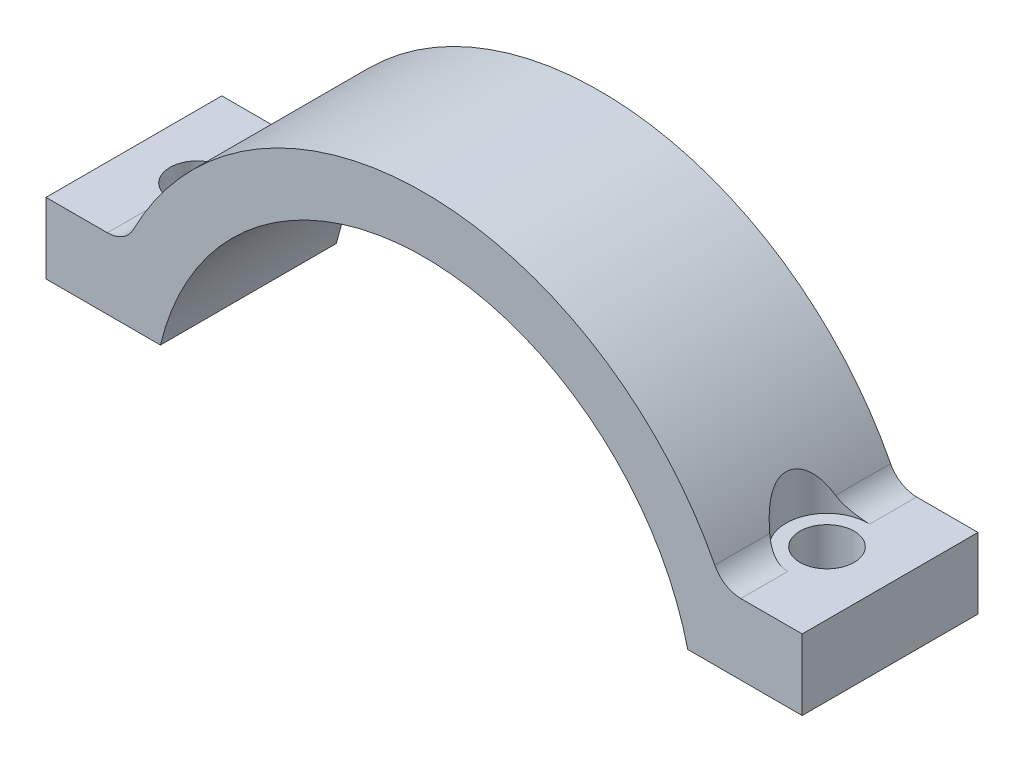
ISO-10303-21;
HEADER;
FILE_DESCRIPTION(('STEP AP214'),'2;1');
FILE_NAME('part.step','',(''),(''),'','','');
FILE_SCHEMA(('AUTOMOTIVE_DESIGN { 1 0 10303 214 1 1 1 1 }'));
ENDSEC;
DATA;
#1=APPLICATION_CONTEXT('core data for automotive mechanical design processes');
#2=APPLICATION_PROTOCOL_DEFINITION('international standard','automotive_design',2000,#1);
#3=PRODUCT_CONTEXT('',#1,'mechanical');
#4=PRODUCT('Part','Part','',(#3));
#5=PRODUCT_RELATED_PRODUCT_CATEGORY('part','',(#4));
#6=PRODUCT_DEFINITION_FORMATION('','',#4);
#7=PRODUCT_DEFINITION_CONTEXT('part definition',#1,'design');
#8=PRODUCT_DEFINITION('design','',#6,#7);
#9=PRODUCT_DEFINITION_SHAPE('','',#8);
#10=(LENGTH_UNIT() NAMED_UNIT(*) SI_UNIT(.MILLI.,.METRE.));
#11=(NAMED_UNIT(*) PLANE_ANGLE_UNIT() SI_UNIT($,.RADIAN.));
#12=(NAMED_UNIT(*) SI_UNIT($,.STERADIAN.) SOLID_ANGLE_UNIT());
#13=UNCERTAINTY_MEASURE_WITH_UNIT(LENGTH_MEASURE(1.E-05),#10,'distance_accuracy_value','');
#14=(GEOMETRIC_REPRESENTATION_CONTEXT(3) GLOBAL_UNCERTAINTY_ASSIGNED_CONTEXT((#13)) GLOBAL_UNIT_ASSIGNED_CONTEXT((#10,
#11,#12)) REPRESENTATION_CONTEXT('',''));
#15=CARTESIAN_POINT('',(0.,0.,0.));
#16=DIRECTION('',(0.,0.,1.));
#17=DIRECTION('',(1.,0.,0.));
#18=AXIS2_PLACEMENT_3D('',#15,#16,#17);
#19=CARTESIAN_POINT('',(0.,-4.2926,-6.));
#20=DIRECTION('',(0.,0.,1.));
#21=DIRECTION('',(1.,0.,0.));
#22=AXIS2_PLACEMENT_3D('',#19,#20,#21);
#23=CYLINDRICAL_SURFACE('',#22,22.31);
#24=DIRECTION('',(0.,0.,1.));
#25=VECTOR('',#24,1.);
#26=CARTESIAN_POINT('',(19.8397891236743,5.91126532291239,-6.));
#27=LINE('',#26,#25);
#28=CARTESIAN_POINT('',(19.8397891236743,5.91126532291239,6.));
#29=VERTEX_POINT('',#28);
#30=CARTESIAN_POINT('',(19.8397891236743,5.91126532291239,2.24725073058836));
#31=VERTEX_POINT('',#30);
#32=EDGE_CURVE('E172',#29,#31,#27,.F.);
#33=ORIENTED_EDGE('',*,*,#32,.T.);
#34=CARTESIAN_POINT('',(20.3614153250701,4.82599999999998,2.55148210615219));
#35=CARTESIAN_POINT('',(20.3280694721854,4.90046048004282,2.53659897847476));
#36=CARTESIAN_POINT('',(20.2943847142534,4.97458096420463,2.52078649791196));
#37=CARTESIAN_POINT('',(20.226380273653,5.12208202628067,2.48712102479289));
#38=CARTESIAN_POINT('',(20.1920604602027,5.19546244687044,2.46926760792105));
#39=CARTESIAN_POINT('',(20.0879884501193,5.41487474667107,2.41224850160538));
#40=CARTESIAN_POINT('',(20.0173608796664,5.55964846974581,2.36972692499178));
#41=CARTESIAN_POINT('',(19.8735992485431,5.84654227079861,2.27350645658121));
#42=CARTESIAN_POINT('',(19.8004453402816,5.98861010651654,2.21968030562438));
#43=CARTESIAN_POINT('',(19.6535731195594,6.26665120377286,2.09908790988041));
#44=CARTESIAN_POINT('',(19.5798559463395,6.40263419602366,2.03234330610812));
#45=CARTESIAN_POINT('',(19.4734198675087,6.59439845708756,1.9239668632264));
#46=CARTESIAN_POINT('',(19.4402803991314,6.6534515220663,1.88850684325897));
#47=CARTESIAN_POINT('',(19.3744463318672,6.76956032713479,1.81409111820734));
#48=CARTESIAN_POINT('',(19.3417517550785,6.82661596823024,1.77513524020498));
#49=CARTESIAN_POINT('',(19.2447205519902,6.9942683196101,1.65258306037027));
#50=CARTESIAN_POINT('',(19.1813829687301,7.10144645703703,1.56324949943804));
#51=CARTESIAN_POINT('',(19.0903266308908,7.25292376608362,1.41538450957065));
#52=CARTESIAN_POINT('',(19.0604059769422,7.30223006494246,1.36330322697164));
#53=CARTESIAN_POINT('',(19.0026555476212,7.3966363191625,1.25440235185756));
#54=CARTESIAN_POINT('',(18.9748261523064,7.44173551029697,1.19758190200332));
#55=CARTESIAN_POINT('',(18.8956664009311,7.5690932980264,1.02006387769636));
#56=CARTESIAN_POINT('',(18.8483190553691,7.64398192248844,0.891776707012844));
#57=CARTESIAN_POINT('',(18.7870262077867,7.74008909088639,0.673326519521865));
#58=CARTESIAN_POINT('',(18.7673272307517,7.77074891815222,0.588872188503999));
#59=CARTESIAN_POINT('',(18.7355992249913,7.81996693364017,0.415083235888803));
#60=CARTESIAN_POINT('',(18.723564465319,7.83853416438247,0.325752315177732));
#61=CARTESIAN_POINT('',(18.7082243995548,7.86217908851298,0.144108191662494));
#62=CARTESIAN_POINT('',(18.7049614802327,7.86719128274683,0.0517826821480479));
#63=CARTESIAN_POINT('',(18.7076204008867,7.86310001371665,-0.132422403836633));
#64=CARTESIAN_POINT('',(18.7135425658574,7.85399605098286,-0.224301964412537));
#65=CARTESIAN_POINT('',(18.7333143949927,7.82347708142833,-0.398897799879052));
#66=CARTESIAN_POINT('',(18.7466316385245,7.80288851795348,-0.481823945326988));
#67=CARTESIAN_POINT('',(18.7797503864223,7.75140302841609,-0.643009497285997));
#68=CARTESIAN_POINT('',(18.7995545872151,7.72050181560441,-0.721266947147147));
#69=CARTESIAN_POINT('',(18.8543731468228,7.63435771664486,-0.905529878202226));
#70=CARTESIAN_POINT('',(18.8922393202388,7.57439545148714,-1.0084745864709));
#71=CARTESIAN_POINT('',(18.975436355526,7.44090324843374,-1.20172704288127));
#72=CARTESIAN_POINT('',(19.0207812202654,7.36734782740215,-1.29201048629595));
#73=CARTESIAN_POINT('',(19.1055235783666,7.2278250217213,-1.44172485308487));
#74=CARTESIAN_POINT('',(19.1439984878001,7.16381255392154,-1.50355019897401));
#75=CARTESIAN_POINT('',(19.2228637065737,7.03098492974606,-1.62051415349791));
#76=CARTESIAN_POINT('',(19.2632551671324,6.96216687477797,-1.67564867056349));
#77=CARTESIAN_POINT('',(19.3454178709917,6.82035018479202,-1.78007001614864));
#78=CARTESIAN_POINT('',(19.387195358302,6.74733108695688,-1.82932385715973));
#79=CARTESIAN_POINT('',(19.4713825977721,6.59816245520193,-1.92225813611611));
#80=CARTESIAN_POINT('',(19.5137925684104,6.52201182280997,-1.96593659590949));
#81=CARTESIAN_POINT('',(19.6259183118197,6.3177868863908,-2.07452752233423));
#82=CARTESIAN_POINT('',(19.695805066428,6.18756066756622,-2.1352244524853));
#83=CARTESIAN_POINT('',(19.8348626716734,5.92194175455493,-2.24535515142847));
#84=CARTESIAN_POINT('',(19.9040325647127,5.78654305979409,-2.29477534445204));
#85=CARTESIAN_POINT('',(20.0391962224542,5.51500847115798,-2.38303369470442));
#86=CARTESIAN_POINT('',(20.1052264470923,5.37896044743748,-2.42208824476457));
#87=CARTESIAN_POINT('',(20.2026312004037,5.1728927922706,-2.47479787468073));
#88=CARTESIAN_POINT('',(20.2347839098546,5.10396493103993,-2.4913707057283));
#89=CARTESIAN_POINT('',(20.2985289598281,4.96545776170059,-2.52272927350247));
#90=CARTESIAN_POINT('',(20.3301213749026,4.89587854217169,-2.53751524953042));
#91=CARTESIAN_POINT('',(20.3614153250701,4.82599999999998,-2.55148210615219));
#92=B_SPLINE_CURVE_WITH_KNOTS('',3,(#34,#35,#36,#37,#38,#39,#40,#41,#42,#43,#44,#45,#46,#47,#48,
#49,#50,#51,#52,#53,#54,#55,#56,#57,#58,#59,#60,#61,#62,#63,#64,#65,#66,#67,#68,#69,#70,#71,#72,
#73,#74,#75,#76,#77,#78,#79,#80,#81,#82,#83,#84,#85,#86,#87,#88,#89,#90,#91),.UNSPECIFIED.,.F.,
.F.,(4,2,2,2,2,2,2,2,2,2,2,2,2,2,2,2,2,2,2,2,2,2,2,2,2,2,2,2,4),(0.,0.248784190534972,
0.497620198291902,0.997056692721159,1.50244977738805,2.0070034420144,2.23622132573599,
2.46545055368498,2.92354515515745,3.15641488773016,3.38932683936229,3.85262521455276,
4.12753894718999,4.40224686994295,4.67827985405699,4.9543226052255,5.21267308528785,
5.47113109019313,5.84405618230874,6.21768762425143,6.50815930074027,6.7988077205391,
7.09101671981405,7.38332910870647,7.86199927126294,8.34124268719908,8.80951254337847,
9.04302072283843,9.27649759539657),.UNSPECIFIED.);
#93=CARTESIAN_POINT('',(19.8397891236743,5.91126532291239,-2.24725073058836));
#94=VERTEX_POINT('',#93);
#95=EDGE_CURVE('E147',#31,#94,#92,.T.);
#96=ORIENTED_EDGE('',*,*,#95,.T.);
#97=CARTESIAN_POINT('',(19.8397891236743,5.91126532291239,-6.));
#98=VERTEX_POINT('',#97);
#99=EDGE_CURVE('E155',#94,#98,#27,.F.);
#100=ORIENTED_EDGE('',*,*,#99,.T.);
#101=CARTESIAN_POINT('',(0.,-4.2926,-6.));
#102=DIRECTION('',(0.,0.,1.));
#103=DIRECTION('',(1.,0.,0.));
#104=AXIS2_PLACEMENT_3D('',#101,#102,#103);
#105=CIRCLE('',#104,22.31);
#106=CARTESIAN_POINT('',(-19.8397891236743,5.91126532291238,-6.));
#107=VERTEX_POINT('',#106);
#108=EDGE_CURVE('E239',#98,#107,#105,.T.);
#109=ORIENTED_EDGE('',*,*,#108,.T.);
#110=DIRECTION('',(0.,0.,1.));
#111=VECTOR('',#110,1.);
#112=CARTESIAN_POINT('',(-19.8397891236743,5.91126532291238,-6.));
#113=LINE('',#112,#111);
#114=CARTESIAN_POINT('',(-19.8397891236743,5.91126532291238,-2.24725073058836));
#115=VERTEX_POINT('',#114);
#116=EDGE_CURVE('E164',#107,#115,#113,.T.);
#117=ORIENTED_EDGE('',*,*,#116,.T.);
#118=CARTESIAN_POINT('',(-20.3614153250701,4.826,-2.55148210615219));
#119=CARTESIAN_POINT('',(-20.3280694721854,4.90046048004284,-2.53659897847475));
#120=CARTESIAN_POINT('',(-20.2943847142533,4.97458096420464,-2.52078649791195));
#121=CARTESIAN_POINT('',(-20.226380273653,5.12208202628068,-2.48712102479288));
#122=CARTESIAN_POINT('',(-20.1920604602027,5.19546244687045,-2.46926760792104));
#123=CARTESIAN_POINT('',(-20.0879884501193,5.41487474667108,-2.41224850160537));
#124=CARTESIAN_POINT('',(-20.0173608796664,5.55964846974582,-2.36972692499178));
#125=CARTESIAN_POINT('',(-19.8735992485431,5.84654227079862,-2.2735064565812));
#126=CARTESIAN_POINT('',(-19.8004453402815,5.98861010651656,-2.21968030562437));
#127=CARTESIAN_POINT('',(-19.6535731195594,6.26665120377287,-2.0990879098804));
#128=CARTESIAN_POINT('',(-19.5798559463395,6.40263419602367,-2.03234330610811));
#129=CARTESIAN_POINT('',(-19.4734198675087,6.59439845708758,-1.9239668632264));
#130=CARTESIAN_POINT('',(-19.4402803991314,6.65345152206632,-1.88850684325896));
#131=CARTESIAN_POINT('',(-19.3744463318672,6.7695603271348,-1.81409111820733));
#132=CARTESIAN_POINT('',(-19.3417517550785,6.82661596823025,-1.77513524020497));
#133=CARTESIAN_POINT('',(-19.2447205519902,6.99426831961011,-1.65258306037027));
#134=CARTESIAN_POINT('',(-19.1813829687301,7.10144645703704,-1.56324949943804));
#135=CARTESIAN_POINT('',(-19.0903266308908,7.25292376608362,-1.41538450957064));
#136=CARTESIAN_POINT('',(-19.0604059769422,7.30223006494246,-1.36330322697163));
#137=CARTESIAN_POINT('',(-19.0026555476212,7.39663631916249,-1.25440235185755));
#138=CARTESIAN_POINT('',(-18.9748261523064,7.44173551029697,-1.19758190200332));
#139=CARTESIAN_POINT('',(-18.8956664009311,7.5690932980264,-1.02006387769636));
#140=CARTESIAN_POINT('',(-18.8483190553691,7.64398192248844,-0.89177670701285));
#141=CARTESIAN_POINT('',(-18.7870262077867,7.74008909088639,-0.673326519521874));
#142=CARTESIAN_POINT('',(-18.7673272307517,7.77074891815222,-0.588872188504008));
#143=CARTESIAN_POINT('',(-18.7355992249914,7.81996693364017,-0.415083235888812));
#144=CARTESIAN_POINT('',(-18.723564465319,7.83853416438247,-0.325752315177741));
#145=CARTESIAN_POINT('',(-18.7082243995548,7.86217908851298,-0.144108191662502));
#146=CARTESIAN_POINT('',(-18.7049614802327,7.86719128274683,-0.0517826821480561));
#147=CARTESIAN_POINT('',(-18.7076204008867,7.86310001371665,0.132422403836625));
#148=CARTESIAN_POINT('',(-18.7135425658574,7.85399605098286,0.224301964412529));
#149=CARTESIAN_POINT('',(-18.7333143949927,7.82347708142832,0.398897799879044));
#150=CARTESIAN_POINT('',(-18.7466316385245,7.80288851795348,0.48182394532698));
#151=CARTESIAN_POINT('',(-18.7797503864223,7.75140302841609,0.643009497285989));
#152=CARTESIAN_POINT('',(-18.7995545872151,7.7205018156044,0.721266947147139));
#153=CARTESIAN_POINT('',(-18.8543731468228,7.63435771664486,0.905529878202217));
#154=CARTESIAN_POINT('',(-18.8922393202388,7.57439545148714,1.00847458647089));
#155=CARTESIAN_POINT('',(-18.975436355526,7.44090324843375,1.20172704288126));
#156=CARTESIAN_POINT('',(-19.0207812202653,7.36734782740216,1.29201048629594));
#157=CARTESIAN_POINT('',(-19.1055235783666,7.22782502172131,1.44172485308486));
#158=CARTESIAN_POINT('',(-19.1439984878001,7.16381255392154,1.50355019897399));
#159=CARTESIAN_POINT('',(-19.2228637065737,7.03098492974606,1.6205141534979));
#160=CARTESIAN_POINT('',(-19.2632551671324,6.96216687477798,1.67564867056348));
#161=CARTESIAN_POINT('',(-19.3454178709917,6.82035018479203,1.78007001614864));
#162=CARTESIAN_POINT('',(-19.387195358302,6.74733108695689,1.82932385715973));
#163=CARTESIAN_POINT('',(-19.4713825977721,6.59816245520194,1.9222581361161));
#164=CARTESIAN_POINT('',(-19.5137925684104,6.52201182280998,1.96593659590948));
#165=CARTESIAN_POINT('',(-19.6259183118197,6.31778688639081,2.07452752233422));
#166=CARTESIAN_POINT('',(-19.695805066428,6.18756066756623,2.13522445248529));
#167=CARTESIAN_POINT('',(-19.8348626716734,5.92194175455494,2.24535515142846));
#168=CARTESIAN_POINT('',(-19.9040325647127,5.7865430597941,2.29477534445203));
#169=CARTESIAN_POINT('',(-20.0391962224542,5.51500847115799,2.38303369470442));
#170=CARTESIAN_POINT('',(-20.1052264470923,5.37896044743749,2.42208824476456));
#171=CARTESIAN_POINT('',(-20.2026312004037,5.17289279227061,2.47479787468073));
#172=CARTESIAN_POINT('',(-20.2347839098546,5.10396493103994,2.49137070572829));
#173=CARTESIAN_POINT('',(-20.2985289598281,4.9654577617006,2.52272927350246));
#174=CARTESIAN_POINT('',(-20.3301213749026,4.8958785421717,2.53751524953042));
#175=CARTESIAN_POINT('',(-20.3614153250701,4.82599999999999,2.55148210615219));
#176=B_SPLINE_CURVE_WITH_KNOTS('',3,(#118,#119,#120,#121,#122,#123,#124,#125,#126,#127,#128,
#129,#130,#131,#132,#133,#134,#135,#136,#137,#138,#139,#140,#141,#142,#143,#144,#145,#146,#147,
#148,#149,#150,#151,#152,#153,#154,#155,#156,#157,#158,#159,#160,#161,#162,#163,#164,#165,#166,
#167,#168,#169,#170,#171,#172,#173,#174,#175),.UNSPECIFIED.,.F.,.F.,(4,2,2,2,2,2,2,2,2,2,2,2,2,
2,2,2,2,2,2,2,2,2,2,2,2,2,2,2,4),(0.,0.248784190534974,0.497620198291904,0.997056692721162,
1.50244977738806,2.0070034420144,2.23622132573599,2.46545055368498,2.92354515515745,
3.15641488773015,3.38932683936227,3.85262521455274,4.12753894718997,4.40224686994293,
4.67827985405696,4.95432260522548,5.21267308528783,5.47113109019311,5.84405618230871,
6.2176876242514,6.50815930074024,6.79880772053907,7.09101671981402,7.38332910870643,
7.86199927126291,8.34124268719905,8.80951254337844,9.0430207228384,9.27649759539654),.UNSPECIFIED.);
#177=CARTESIAN_POINT('',(-19.8397891236743,5.91126532291238,2.24725073058836));
#178=VERTEX_POINT('',#177);
#179=EDGE_CURVE('E206',#115,#178,#176,.T.);
#180=ORIENTED_EDGE('',*,*,#179,.T.);
#181=CARTESIAN_POINT('',(-19.8397891236743,5.91126532291238,6.));
#182=VERTEX_POINT('',#181);
#183=EDGE_CURVE('E161',#178,#182,#113,.T.);
#184=ORIENTED_EDGE('',*,*,#183,.T.);
#185=CARTESIAN_POINT('',(0.,-4.2926,6.));
#186=DIRECTION('',(0.,0.,1.));
#187=DIRECTION('',(1.,0.,0.));
#188=AXIS2_PLACEMENT_3D('',#185,#186,#187);
#189=CIRCLE('',#188,22.31);
#190=EDGE_CURVE('E287',#29,#182,#189,.T.);
#191=ORIENTED_EDGE('',*,*,#190,.F.);
#192=EDGE_LOOP('',(#33,#96,#100,#109,#117,#180,#184,#191));
#193=FACE_BOUND('',#192,.T.);
#194=ADVANCED_FACE('F33',(#193),#23,.T.);
#195=CARTESIAN_POINT('',(21.6183448496873,6.82600000000001,-6.));
#196=DIRECTION('',(0.,0.,1.));
#197=DIRECTION('',(1.,0.,0.));
#198=AXIS2_PLACEMENT_3D('',#195,#196,#197);
#199=CYLINDRICAL_SURFACE('',#198,2.);
#200=CARTESIAN_POINT('',(21.6183448496873,4.82600000000001,-2.79149252131409));
#201=CARTESIAN_POINT('',(21.5693155741206,4.82598996873853,-2.79358182972233));
#202=CARTESIAN_POINT('',(21.5202361734305,4.82780261130843,-2.79435807952098));
#203=CARTESIAN_POINT('',(21.4223932547721,4.83502096136869,-2.79334740970336));
#204=CARTESIAN_POINT('',(21.3736295884988,4.84042483632767,-2.79156179681421));
#205=CARTESIAN_POINT('',(21.2770979388307,4.85472687136218,-2.7855120593245));
#206=CARTESIAN_POINT('',(21.2293255459031,4.86360211135028,-2.78126410569772));
#207=CARTESIAN_POINT('',(21.1348119987465,4.88472618910914,-2.77044040179852));
#208=CARTESIAN_POINT('',(21.0880709214149,4.89697527753007,-2.76386447856607));
#209=CARTESIAN_POINT('',(20.9500358295848,4.93852474159264,-2.74091884513661));
#210=CARTESIAN_POINT('',(20.8606774173642,4.97266561342919,-2.72131402990484));
#211=CARTESIAN_POINT('',(20.6891117324284,5.05243948198772,-2.67522491734088));
#212=CARTESIAN_POINT('',(20.6069166245686,5.09809153446974,-2.64872921042708));
#213=CARTESIAN_POINT('',(20.444832081341,5.2033734475482,-2.5886462495256));
#214=CARTESIAN_POINT('',(20.3656161872093,5.26381292556409,-2.55466830918485));
#215=CARTESIAN_POINT('',(20.2177280512011,5.3949016112656,-2.48373609393735));
#216=CARTESIAN_POINT('',(20.149055198805,5.46555022730684,-2.44678199156131));
#217=CARTESIAN_POINT('',(20.0383510368984,5.59754095045192,-2.38181881152703));
#218=CARTESIAN_POINT('',(19.9939196407525,5.65690448746061,-2.35384288772138));
#219=CARTESIAN_POINT('',(19.9117766318131,5.78048879609469,-2.29922366883206));
#220=CARTESIAN_POINT('',(19.8740524881671,5.8447001838895,-2.27257795703995));
#221=CARTESIAN_POINT('',(19.8397891236743,5.91126532291239,-2.24725073058836));
#222=B_SPLINE_CURVE_WITH_KNOTS('',3,(#200,#201,#202,#203,#204,#205,#206,#207,#208,#209,#210,
#211,#212,#213,#214,#215,#216,#217,#218,#219,#220,#221),.UNSPECIFIED.,.F.,.F.,(4,2,2,2,2,2,2,2,
2,2,4),(0.,0.147161125600288,0.294247215531748,0.440378115707454,0.586519875179679,
0.878045358015662,1.17005664118481,1.48472144323325,1.79936801699847,2.03670309115988,
2.27358999413944),.UNSPECIFIED.);
#223=CARTESIAN_POINT('',(21.6183448496873,4.82599999999998,-2.79149252131409));
#224=VERTEX_POINT('',#223);
#225=EDGE_CURVE('E11',#224,#94,#222,.T.);
#226=ORIENTED_EDGE('',*,*,#225,.F.);
#227=DIRECTION('',(0.,0.,-1.));
#228=VECTOR('',#227,1.);
#229=CARTESIAN_POINT('',(21.6183448496873,4.82600000000001,6.));
#230=LINE('',#229,#228);
#231=CARTESIAN_POINT('',(21.6183448496873,4.82600000000001,-6.));
#232=VERTEX_POINT('',#231);
#233=EDGE_CURVE('E154',#232,#224,#230,.F.);
#234=ORIENTED_EDGE('',*,*,#233,.F.);
#235=CARTESIAN_POINT('',(21.6183448496873,6.82600000000001,-6.));
#236=DIRECTION('',(0.,0.,1.));
#237=DIRECTION('',(1.,0.,0.));
#238=AXIS2_PLACEMENT_3D('',#235,#236,#237);
#239=CIRCLE('',#238,2.);
#240=EDGE_CURVE('E180',#98,#232,#239,.T.);
#241=ORIENTED_EDGE('',*,*,#240,.F.);
#242=ORIENTED_EDGE('',*,*,#99,.F.);
#243=EDGE_LOOP('',(#226,#234,#241,#242));
#244=FACE_BOUND('',#243,.T.);
#245=ADVANCED_FACE('F152',(#244),#199,.F.);
#246=CARTESIAN_POINT('',(19.8397891236743,5.91126532291239,2.24725073058836));
#247=CARTESIAN_POINT('',(19.8669049633739,5.85856333048831,2.26728930279306));
#248=CARTESIAN_POINT('',(19.8962057030498,5.80733315965302,2.28817187715238));
#249=CARTESIAN_POINT('',(19.9589988398688,5.70795016828922,2.33091954347855));
#250=CARTESIAN_POINT('',(19.9924907158218,5.6597969662462,2.35278451306305));
#251=CARTESIAN_POINT('',(20.0637492540761,5.56635480182286,2.39695453194847));
#252=CARTESIAN_POINT('',(20.1015448338865,5.52108884130667,2.41926161220232));
#253=CARTESIAN_POINT('',(20.1810657871339,5.43398387020636,2.46351822771005));
#254=CARTESIAN_POINT('',(20.2227913264081,5.39214500437875,2.48546774782966));
#255=CARTESIAN_POINT('',(20.3537842492671,5.27199539873037,2.54991809057111));
#256=CARTESIAN_POINT('',(20.4488545123134,5.19906929803017,2.59101196715686));
#257=CARTESIAN_POINT('',(20.6526564550114,5.07047416167249,2.66460253299051));
#258=CARTESIAN_POINT('',(20.7613406955655,5.01474742240481,2.69712791441481));
#259=CARTESIAN_POINT('',(20.9616277080522,4.93461211951003,2.74306905187741));
#260=CARTESIAN_POINT('',(21.0508816937111,4.9058744992336,2.75921520162049));
#261=CARTESIAN_POINT('',(21.2335894931767,4.86111841436343,2.78278468221493));
#262=CARTESIAN_POINT('',(21.3270352612684,4.8450765996629,2.79022403871576));
#263=CARTESIAN_POINT('',(21.4539369868464,4.83249439024607,2.79381491478988));
#264=CARTESIAN_POINT('',(21.4867973917508,4.8300581605662,2.79416321176885));
#265=CARTESIAN_POINT('',(21.5525568961414,4.82681246179304,2.79369820827285));
#266=CARTESIAN_POINT('',(21.5854559226813,4.82600134685602,2.79288608445024));
#267=CARTESIAN_POINT('',(21.6183448496873,4.82600000000001,2.79149252131409));
#268=B_SPLINE_CURVE_WITH_KNOTS('',3,(#246,#247,#248,#249,#250,#251,#252,#253,#254,#255,#256,
#257,#258,#259,#260,#261,#262,#263,#264,#265,#266,#267),.UNSPECIFIED.,.F.,.F.,(4,2,2,2,2,2,2,2,
2,2,4),(0.,0.187599302769327,0.375175299715322,0.564095676335825,0.75302402862405,
1.13095133818247,1.50759656704884,1.79185994478956,2.07559928281619,2.17441059238471,
2.27312177957883),.UNSPECIFIED.);
#269=CARTESIAN_POINT('',(21.6183448496873,4.82599999999998,2.79149252131409));
#270=VERTEX_POINT('',#269);
#271=EDGE_CURVE('E46',#31,#270,#268,.T.);
#272=ORIENTED_EDGE('',*,*,#271,.F.);
#273=ORIENTED_EDGE('',*,*,#32,.F.);
#274=CARTESIAN_POINT('',(21.6183448496873,6.82600000000001,6.));
#275=DIRECTION('',(0.,0.,1.));
#276=DIRECTION('',(1.,0.,0.));
#277=AXIS2_PLACEMENT_3D('',#274,#275,#276);
#278=CIRCLE('',#277,2.);
#279=CARTESIAN_POINT('',(21.6183448496873,4.82600000000001,6.));
#280=VERTEX_POINT('',#279);
#281=EDGE_CURVE('E178',#280,#29,#278,.F.);
#282=ORIENTED_EDGE('',*,*,#281,.F.);
#283=EDGE_CURVE('E162',#270,#280,#230,.F.);
#284=ORIENTED_EDGE('',*,*,#283,.F.);
#285=EDGE_LOOP('',(#272,#273,#282,#284));
#286=FACE_BOUND('',#285,.T.);
#287=ADVANCED_FACE('F304',(#286),#199,.F.);
#288=CARTESIAN_POINT('',(-21.6183448496873,6.826,-6.));
#289=DIRECTION('',(0.,0.,1.));
#290=DIRECTION('',(1.,0.,0.));
#291=AXIS2_PLACEMENT_3D('',#288,#289,#290);
#292=CYLINDRICAL_SURFACE('',#291,2.);
#293=CARTESIAN_POINT('',(-19.8397891236743,5.91126532291238,-2.24725073058836));
#294=CARTESIAN_POINT('',(-19.8669049633739,5.8585633304883,-2.26728930279306));
#295=CARTESIAN_POINT('',(-19.8962057030498,5.80733315965301,-2.28817187715238));
#296=CARTESIAN_POINT('',(-19.9589988398688,5.7079501682892,-2.33091954347856));
#297=CARTESIAN_POINT('',(-19.9924907158218,5.65979696624619,-2.35278451306305));
#298=CARTESIAN_POINT('',(-20.0637492540761,5.56635480182284,-2.39695453194847));
#299=CARTESIAN_POINT('',(-20.1015448338865,5.52108884130666,-2.41926161220232));
#300=CARTESIAN_POINT('',(-20.1810657871339,5.43398387020635,-2.46351822771005));
#301=CARTESIAN_POINT('',(-20.2227913264081,5.39214500437874,-2.48546774782966));
#302=CARTESIAN_POINT('',(-20.3537842492671,5.27199539873036,-2.54991809057111));
#303=CARTESIAN_POINT('',(-20.4488545123134,5.19906929803015,-2.59101196715686));
#304=CARTESIAN_POINT('',(-20.6526564550114,5.07047416167247,-2.66460253299051));
#305=CARTESIAN_POINT('',(-20.7613406955655,5.01474742240479,-2.69712791441481));
#306=CARTESIAN_POINT('',(-20.9616277080522,4.93461211951001,-2.74306905187741));
#307=CARTESIAN_POINT('',(-21.0508816937111,4.90587449923359,-2.75921520162049));
#308=CARTESIAN_POINT('',(-21.2335894931767,4.86111841436342,-2.78278468221493));
#309=CARTESIAN_POINT('',(-21.3270352612684,4.84507659966288,-2.79022403871576));
#310=CARTESIAN_POINT('',(-21.4539369868464,4.83249439024606,-2.79381491478988));
#311=CARTESIAN_POINT('',(-21.4867973917508,4.83005816056619,-2.79416321176885));
#312=CARTESIAN_POINT('',(-21.5525568961414,4.82681246179303,-2.79369820827285));
#313=CARTESIAN_POINT('',(-21.5854559226813,4.82600134685601,-2.79288608445024));
#314=CARTESIAN_POINT('',(-21.6183448496873,4.82599999999999,-2.79149252131409));
#315=B_SPLINE_CURVE_WITH_KNOTS('',3,(#293,#294,#295,#296,#297,#298,#299,#300,#301,#302,#303,
#304,#305,#306,#307,#308,#309,#310,#311,#312,#313,#314),.UNSPECIFIED.,.F.,.F.,(4,2,2,2,2,2,2,2,
2,2,4),(0.,0.18759930276933,0.375175299715328,0.564095676335832,0.753024028624052,
1.13095133818248,1.50759656704884,1.79185994478956,2.0755992828162,2.17441059238471,
2.27312177957883),.UNSPECIFIED.);
#316=CARTESIAN_POINT('',(-21.6183448496873,4.826,-2.79149252131409));
#317=VERTEX_POINT('',#316);
#318=EDGE_CURVE('E191',#115,#317,#315,.T.);
#319=ORIENTED_EDGE('',*,*,#318,.F.);
#320=ORIENTED_EDGE('',*,*,#116,.F.);
#321=CARTESIAN_POINT('',(-21.6183448496873,6.826,-6.));
#322=DIRECTION('',(0.,0.,1.));
#323=DIRECTION('',(1.,0.,0.));
#324=AXIS2_PLACEMENT_3D('',#321,#322,#323);
#325=CIRCLE('',#324,2.);
#326=CARTESIAN_POINT('',(-21.6183448496873,4.826,-6.));
#327=VERTEX_POINT('',#326);
#328=EDGE_CURVE('E183',#327,#107,#325,.T.);
#329=ORIENTED_EDGE('',*,*,#328,.F.);
#330=DIRECTION('',(0.,0.,-1.));
#331=VECTOR('',#330,1.);
#332=CARTESIAN_POINT('',(-21.6183448496873,4.826,-6.));
#333=LINE('',#332,#331);
#334=EDGE_CURVE('E53',#317,#327,#333,.T.);
#335=ORIENTED_EDGE('',*,*,#334,.F.);
#336=EDGE_LOOP('',(#319,#320,#329,#335));
#337=FACE_BOUND('',#336,.T.);
#338=ADVANCED_FACE('F35',(#337),#292,.F.);
#339=CARTESIAN_POINT('',(-21.6183448496873,4.826,2.79149252131409));
#340=CARTESIAN_POINT('',(-21.5693155741206,4.82598996873852,2.79358182972233));
#341=CARTESIAN_POINT('',(-21.5202361734305,4.82780261130842,2.79435807952098));
#342=CARTESIAN_POINT('',(-21.422393254772,4.83502096136868,2.79334740970336));
#343=CARTESIAN_POINT('',(-21.3736295884988,4.84042483632765,2.79156179681421));
#344=CARTESIAN_POINT('',(-21.2770979388307,4.85472687136217,2.7855120593245));
#345=CARTESIAN_POINT('',(-21.2293255459031,4.86360211135027,2.78126410569772));
#346=CARTESIAN_POINT('',(-21.1348119987465,4.88472618910912,2.77044040179852));
#347=CARTESIAN_POINT('',(-21.0880709214149,4.89697527753006,2.76386447856607));
#348=CARTESIAN_POINT('',(-20.9500358295848,4.93852474159263,2.74091884513661));
#349=CARTESIAN_POINT('',(-20.8606774173642,4.97266561342918,2.72131402990484));
#350=CARTESIAN_POINT('',(-20.6891117324284,5.05243948198771,2.67522491734088));
#351=CARTESIAN_POINT('',(-20.6069166245686,5.09809153446973,2.64872921042708));
#352=CARTESIAN_POINT('',(-20.444832081341,5.20337344754819,2.5886462495256));
#353=CARTESIAN_POINT('',(-20.3656161872093,5.26381292556408,2.55466830918485));
#354=CARTESIAN_POINT('',(-20.2177280512011,5.39490161126559,2.48373609393735));
#355=CARTESIAN_POINT('',(-20.149055198805,5.46555022730683,2.44678199156131));
#356=CARTESIAN_POINT('',(-20.0383510368984,5.59754095045191,2.38181881152703));
#357=CARTESIAN_POINT('',(-19.9939196407525,5.6569044874606,2.35384288772138));
#358=CARTESIAN_POINT('',(-19.9117766318131,5.78048879609467,2.29922366883206));
#359=CARTESIAN_POINT('',(-19.8740524881671,5.84470018388949,2.27257795703995));
#360=CARTESIAN_POINT('',(-19.8397891236743,5.91126532291238,2.24725073058836));
#361=B_SPLINE_CURVE_WITH_KNOTS('',3,(#339,#340,#341,#342,#343,#344,#345,#346,#347,#348,#349,
#350,#351,#352,#353,#354,#355,#356,#357,#358,#359,#360),.UNSPECIFIED.,.F.,.F.,(4,2,2,2,2,2,2,2,
2,2,4),(0.,0.147161125600295,0.294247215531748,0.440378115707454,0.586519875179679,
0.878045358015666,1.17005664118481,1.48472144323324,1.79936801699847,2.03670309115987,
2.27358999413944),.UNSPECIFIED.);
#362=CARTESIAN_POINT('',(-21.6183448496873,4.826,2.79149252131409));
#363=VERTEX_POINT('',#362);
#364=EDGE_CURVE('E185',#363,#178,#361,.T.);
#365=ORIENTED_EDGE('',*,*,#364,.F.);
#366=CARTESIAN_POINT('',(-21.6183448496873,4.826,6.));
#367=VERTEX_POINT('',#366);
#368=EDGE_CURVE('E175',#367,#363,#333,.T.);
#369=ORIENTED_EDGE('',*,*,#368,.F.);
#370=CARTESIAN_POINT('',(-21.6183448496873,6.826,6.));
#371=DIRECTION('',(0.,0.,1.));
#372=DIRECTION('',(1.,0.,0.));
#373=AXIS2_PLACEMENT_3D('',#370,#371,#372);
#374=CIRCLE('',#373,2.);
#375=EDGE_CURVE('E61',#182,#367,#374,.F.);
#376=ORIENTED_EDGE('',*,*,#375,.F.);
#377=ORIENTED_EDGE('',*,*,#183,.F.);
#378=EDGE_LOOP('',(#365,#369,#376,#377));
#379=FACE_BOUND('',#378,.T.);
#380=ADVANCED_FACE('F329',(#379),#292,.F.);
#381=CARTESIAN_POINT('',(-25.8064,0.,-6.));
#382=DIRECTION('',(0.,-1.,0.));
#383=DIRECTION('',(0.,0.,-1.));
#384=AXIS2_PLACEMENT_3D('',#381,#382,#383);
#385=PLANE('',#384);
#386=DIRECTION('',(0.,0.,1.));
#387=VECTOR('',#386,1.);
#388=CARTESIAN_POINT('',(-17.9950989227623,0.,-6.));
#389=LINE('',#388,#387);
#390=CARTESIAN_POINT('',(-17.9950989227623,0.,-6.));
#391=VERTEX_POINT('',#390);
#392=CARTESIAN_POINT('',(-17.9950989227623,0.,6.));
#393=VERTEX_POINT('',#392);
#394=EDGE_CURVE('E271',#391,#393,#389,.T.);
#395=ORIENTED_EDGE('',*,*,#394,.T.);
#396=DIRECTION('',(1.,0.,0.));
#397=VECTOR('',#396,1.);
#398=CARTESIAN_POINT('',(-25.8064,0.,6.));
#399=LINE('',#398,#397);
#400=CARTESIAN_POINT('',(-25.8064,0.,6.));
#401=VERTEX_POINT('',#400);
#402=EDGE_CURVE('E283',#401,#393,#399,.T.);
#403=ORIENTED_EDGE('',*,*,#402,.F.);
#404=DIRECTION('',(0.,0.,1.));
#405=VECTOR('',#404,1.);
#406=CARTESIAN_POINT('',(-25.8064,0.,-6.));
#407=LINE('',#406,#405);
#408=CARTESIAN_POINT('',(-25.8064,0.,-6.));
#409=VERTEX_POINT('',#408);
#410=EDGE_CURVE('E272',#409,#401,#407,.T.);
#411=ORIENTED_EDGE('',*,*,#410,.F.);
#412=DIRECTION('',(1.,0.,0.));
#413=VECTOR('',#412,1.);
#414=CARTESIAN_POINT('',(-25.8064,0.,-6.));
#415=LINE('',#414,#413);
#416=EDGE_CURVE('E253',#409,#391,#415,.T.);
#417=ORIENTED_EDGE('',*,*,#416,.T.);
#418=EDGE_LOOP('',(#395,#403,#411,#417));
#419=FACE_BOUND('',#418,.T.);
#420=CARTESIAN_POINT('',(-21.5,0.,0.));
#421=DIRECTION('',(0.,-1.,0.));
#422=DIRECTION('',(0.,0.,-1.));
#423=AXIS2_PLACEMENT_3D('',#420,#421,#422);
#424=CIRCLE('',#423,1.85);
#425=CARTESIAN_POINT('',(-21.5,0.,-1.85));
#426=VERTEX_POINT('',#425);
#427=EDGE_CURVE('E313',#426,#426,#424,.F.);
#428=ORIENTED_EDGE('',*,*,#427,.T.);
#429=EDGE_LOOP('',(#428));
#430=FACE_BOUND('',#429,.T.);
#431=ADVANCED_FACE('F322',(#419,#430),#385,.T.);
#432=CARTESIAN_POINT('',(-20.3614153250701,4.826,-6.));
#433=DIRECTION('',(0.,1.,0.));
#434=DIRECTION('',(-1.,0.,0.));
#435=AXIS2_PLACEMENT_3D('',#432,#433,#434);
#436=PLANE('',#435);
#437=CARTESIAN_POINT('',(-21.5,4.826,0.));
#438=DIRECTION('',(0.,1.,0.));
#439=DIRECTION('',(0.,0.,-1.));
#440=AXIS2_PLACEMENT_3D('',#437,#438,#439);
#441=CIRCLE('',#440,1.85);
#442=CARTESIAN_POINT('',(-21.5,4.826,-1.85));
#443=VERTEX_POINT('',#442);
#444=EDGE_CURVE('E214',#443,#443,#441,.T.);
#445=ORIENTED_EDGE('',*,*,#444,.F.);
#446=EDGE_LOOP('',(#445));
#447=FACE_BOUND('',#446,.T.);
#448=CARTESIAN_POINT('',(-21.5,4.826,0.));
#449=DIRECTION('',(0.,1.,0.));
#450=DIRECTION('',(-1.,0.,0.));
#451=AXIS2_PLACEMENT_3D('',#448,#449,#450);
#452=CIRCLE('',#451,2.794);
#453=EDGE_CURVE('E215',#363,#317,#452,.T.);
#454=ORIENTED_EDGE('',*,*,#453,.T.);
#455=ORIENTED_EDGE('',*,*,#334,.T.);
#456=DIRECTION('',(-1.,0.,0.));
#457=VECTOR('',#456,1.);
#458=CARTESIAN_POINT('',(-20.3614153250701,4.826,-6.));
#459=LINE('',#458,#457);
#460=CARTESIAN_POINT('',(-25.8064,4.826,-6.));
#461=VERTEX_POINT('',#460);
#462=EDGE_CURVE('E241',#327,#461,#459,.T.);
#463=ORIENTED_EDGE('',*,*,#462,.T.);
#464=DIRECTION('',(0.,0.,1.));
#465=VECTOR('',#464,1.);
#466=CARTESIAN_POINT('',(-25.8064,4.826,-6.));
#467=LINE('',#466,#465);
#468=CARTESIAN_POINT('',(-25.8064,4.826,6.));
#469=VERTEX_POINT('',#468);
#470=EDGE_CURVE('E168',#461,#469,#467,.T.);
#471=ORIENTED_EDGE('',*,*,#470,.T.);
#472=DIRECTION('',(-1.,0.,0.));
#473=VECTOR('',#472,1.);
#474=CARTESIAN_POINT('',(-20.3614153250701,4.826,6.));
#475=LINE('',#474,#473);
#476=EDGE_CURVE('E278',#367,#469,#475,.T.);
#477=ORIENTED_EDGE('',*,*,#476,.F.);
#478=ORIENTED_EDGE('',*,*,#368,.T.);
#479=EDGE_LOOP('',(#454,#455,#463,#471,#477,#478));
#480=FACE_BOUND('',#479,.T.);
#481=ADVANCED_FACE('F222',(#447,#480),#436,.T.);
#482=CARTESIAN_POINT('',(25.8064,4.82600000000001,-6.));
#483=DIRECTION('',(0.,1.,0.));
#484=DIRECTION('',(-1.,0.,0.));
#485=AXIS2_PLACEMENT_3D('',#482,#483,#484);
#486=PLANE('',#485);
#487=CARTESIAN_POINT('',(21.5,4.82599999999998,0.));
#488=DIRECTION('',(0.,1.,0.));
#489=DIRECTION('',(1.,0.,0.));
#490=AXIS2_PLACEMENT_3D('',#487,#488,#489);
#491=CIRCLE('',#490,2.794);
#492=EDGE_CURVE('E139',#224,#270,#491,.T.);
#493=ORIENTED_EDGE('',*,*,#492,.T.);
#494=ORIENTED_EDGE('',*,*,#283,.T.);
#495=DIRECTION('',(-1.,0.,0.));
#496=VECTOR('',#495,1.);
#497=CARTESIAN_POINT('',(25.8064,4.82600000000001,6.));
#498=LINE('',#497,#496);
#499=CARTESIAN_POINT('',(25.8064,4.82600000000001,6.));
#500=VERTEX_POINT('',#499);
#501=EDGE_CURVE('E242',#500,#280,#498,.T.);
#502=ORIENTED_EDGE('',*,*,#501,.F.);
#503=DIRECTION('',(0.,0.,1.));
#504=VECTOR('',#503,1.);
#505=CARTESIAN_POINT('',(25.8064,4.82600000000001,-6.));
#506=LINE('',#505,#504);
#507=CARTESIAN_POINT('',(25.8064,4.82600000000001,-6.));
#508=VERTEX_POINT('',#507);
#509=EDGE_CURVE('E166',#508,#500,#506,.T.);
#510=ORIENTED_EDGE('',*,*,#509,.F.);
#511=DIRECTION('',(-1.,0.,0.));
#512=VECTOR('',#511,1.);
#513=CARTESIAN_POINT('',(25.8064,4.82600000000001,-6.));
#514=LINE('',#513,#512);
#515=EDGE_CURVE('E160',#508,#232,#514,.T.);
#516=ORIENTED_EDGE('',*,*,#515,.T.);
#517=ORIENTED_EDGE('',*,*,#233,.T.);
#518=EDGE_LOOP('',(#493,#494,#502,#510,#516,#517));
#519=FACE_BOUND('',#518,.T.);
#520=CARTESIAN_POINT('',(21.5,4.826,0.));
#521=DIRECTION('',(0.,1.,0.));
#522=DIRECTION('',(0.,0.,1.));
#523=AXIS2_PLACEMENT_3D('',#520,#521,#522);
#524=CIRCLE('',#523,1.85);
#525=CARTESIAN_POINT('',(21.5,4.826,1.85));
#526=VERTEX_POINT('',#525);
#527=EDGE_CURVE('E309',#526,#526,#524,.T.);
#528=ORIENTED_EDGE('',*,*,#527,.F.);
#529=EDGE_LOOP('',(#528));
#530=FACE_BOUND('',#529,.T.);
#531=ADVANCED_FACE('F157',(#519,#530),#486,.T.);
#532=CARTESIAN_POINT('',(25.8064,0.,-6.));
#533=DIRECTION('',(0.,-1.,0.));
#534=DIRECTION('',(1.,0.,0.));
#535=AXIS2_PLACEMENT_3D('',#532,#533,#534);
#536=PLANE('',#535);
#537=DIRECTION('',(0.,0.,1.));
#538=VECTOR('',#537,1.);
#539=CARTESIAN_POINT('',(25.8064,0.,-6.));
#540=LINE('',#539,#538);
#541=CARTESIAN_POINT('',(25.8064,0.,-6.));
#542=VERTEX_POINT('',#541);
#543=CARTESIAN_POINT('',(25.8064,0.,6.));
#544=VERTEX_POINT('',#543);
#545=EDGE_CURVE('E267',#542,#544,#540,.T.);
#546=ORIENTED_EDGE('',*,*,#545,.T.);
#547=DIRECTION('',(1.,0.,0.));
#548=VECTOR('',#547,1.);
#549=CARTESIAN_POINT('',(25.8064,0.,6.));
#550=LINE('',#549,#548);
#551=CARTESIAN_POINT('',(17.9950989227623,0.,6.));
#552=VERTEX_POINT('',#551);
#553=EDGE_CURVE('E293',#552,#544,#550,.T.);
#554=ORIENTED_EDGE('',*,*,#553,.F.);
#555=DIRECTION('',(0.,0.,1.));
#556=VECTOR('',#555,1.);
#557=CARTESIAN_POINT('',(17.9950989227623,0.,-6.));
#558=LINE('',#557,#556);
#559=CARTESIAN_POINT('',(17.9950989227623,0.,-6.));
#560=VERTEX_POINT('',#559);
#561=EDGE_CURVE('E269',#560,#552,#558,.T.);
#562=ORIENTED_EDGE('',*,*,#561,.F.);
#563=DIRECTION('',(1.,0.,0.));
#564=VECTOR('',#563,1.);
#565=CARTESIAN_POINT('',(25.8064,0.,-6.));
#566=LINE('',#565,#564);
#567=EDGE_CURVE('E259',#560,#542,#566,.T.);
#568=ORIENTED_EDGE('',*,*,#567,.T.);
#569=EDGE_LOOP('',(#546,#554,#562,#568));
#570=FACE_BOUND('',#569,.T.);
#571=CARTESIAN_POINT('',(21.5,0.,0.));
#572=DIRECTION('',(0.,-1.,0.));
#573=DIRECTION('',(1.,0.,0.));
#574=AXIS2_PLACEMENT_3D('',#571,#572,#573);
#575=CIRCLE('',#574,1.85);
#576=CARTESIAN_POINT('',(23.35,0.,0.));
#577=VERTEX_POINT('',#576);
#578=EDGE_CURVE('E307',#577,#577,#575,.F.);
#579=ORIENTED_EDGE('',*,*,#578,.T.);
#580=EDGE_LOOP('',(#579));
#581=FACE_BOUND('',#580,.T.);
#582=ADVANCED_FACE('F327',(#570,#581),#536,.T.);
#583=CARTESIAN_POINT('',(25.8064,0.,-6.));
#584=DIRECTION('',(1.,0.,0.));
#585=DIRECTION('',(0.,0.,-1.));
#586=AXIS2_PLACEMENT_3D('',#583,#584,#585);
#587=PLANE('',#586);
#588=ORIENTED_EDGE('',*,*,#509,.T.);
#589=DIRECTION('',(0.,1.,0.));
#590=VECTOR('',#589,1.);
#591=CARTESIAN_POINT('',(25.8064,0.,6.));
#592=LINE('',#591,#590);
#593=EDGE_CURVE('E247',#544,#500,#592,.T.);
#594=ORIENTED_EDGE('',*,*,#593,.F.);
#595=ORIENTED_EDGE('',*,*,#545,.F.);
#596=DIRECTION('',(0.,1.,0.));
#597=VECTOR('',#596,1.);
#598=CARTESIAN_POINT('',(25.8064,0.,-6.));
#599=LINE('',#598,#597);
#600=EDGE_CURVE('E262',#542,#508,#599,.T.);
#601=ORIENTED_EDGE('',*,*,#600,.T.);
#602=EDGE_LOOP('',(#588,#594,#595,#601));
#603=FACE_BOUND('',#602,.T.);
#604=ADVANCED_FACE('F345',(#603),#587,.T.);
#605=CARTESIAN_POINT('',(0.,-4.2926,-6.));
#606=DIRECTION('',(0.,0.,1.));
#607=DIRECTION('',(1.,0.,0.));
#608=AXIS2_PLACEMENT_3D('',#605,#606,#607);
#609=CYLINDRICAL_SURFACE('',#608,18.5);
#610=ORIENTED_EDGE('',*,*,#561,.T.);
#611=CARTESIAN_POINT('',(0.,-4.2926,6.));
#612=DIRECTION('',(0.,0.,-1.));
#613=DIRECTION('',(1.,0.,0.));
#614=AXIS2_PLACEMENT_3D('',#611,#612,#613);
#615=CIRCLE('',#614,18.5);
#616=EDGE_CURVE('E285',#393,#552,#615,.T.);
#617=ORIENTED_EDGE('',*,*,#616,.F.);
#618=ORIENTED_EDGE('',*,*,#394,.F.);
#619=CARTESIAN_POINT('',(0.,-4.2926,-6.));
#620=DIRECTION('',(0.,0.,-1.));
#621=DIRECTION('',(1.,0.,0.));
#622=AXIS2_PLACEMENT_3D('',#619,#620,#621);
#623=CIRCLE('',#622,18.5);
#624=EDGE_CURVE('E256',#391,#560,#623,.T.);
#625=ORIENTED_EDGE('',*,*,#624,.T.);
#626=EDGE_LOOP('',(#610,#617,#618,#625));
#627=FACE_BOUND('',#626,.T.);
#628=ADVANCED_FACE('F337',(#627),#609,.F.);
#629=CARTESIAN_POINT('',(-25.8064,4.826,-6.));
#630=DIRECTION('',(-1.,0.,0.));
#631=DIRECTION('',(0.,0.,1.));
#632=AXIS2_PLACEMENT_3D('',#629,#630,#631);
#633=PLANE('',#632);
#634=ORIENTED_EDGE('',*,*,#410,.T.);
#635=DIRECTION('',(0.,-1.,0.));
#636=VECTOR('',#635,1.);
#637=CARTESIAN_POINT('',(-25.8064,4.826,6.));
#638=LINE('',#637,#636);
#639=EDGE_CURVE('E279',#469,#401,#638,.T.);
#640=ORIENTED_EDGE('',*,*,#639,.F.);
#641=ORIENTED_EDGE('',*,*,#470,.F.);
#642=DIRECTION('',(0.,-1.,0.));
#643=VECTOR('',#642,1.);
#644=CARTESIAN_POINT('',(-25.8064,4.826,-6.));
#645=LINE('',#644,#643);
#646=EDGE_CURVE('E244',#461,#409,#645,.T.);
#647=ORIENTED_EDGE('',*,*,#646,.T.);
#648=EDGE_LOOP('',(#634,#640,#641,#647));
#649=FACE_BOUND('',#648,.T.);
#650=ADVANCED_FACE('F280',(#649),#633,.T.);
#651=CARTESIAN_POINT('',(0.,-4.2926,-6.));
#652=DIRECTION('',(0.,0.,1.));
#653=DIRECTION('',(1.,0.,0.));
#654=AXIS2_PLACEMENT_3D('',#651,#652,#653);
#655=PLANE('',#654);
#656=ORIENTED_EDGE('',*,*,#108,.F.);
#657=ORIENTED_EDGE('',*,*,#240,.T.);
#658=ORIENTED_EDGE('',*,*,#515,.F.);
#659=ORIENTED_EDGE('',*,*,#600,.F.);
#660=ORIENTED_EDGE('',*,*,#567,.F.);
#661=ORIENTED_EDGE('',*,*,#624,.F.);
#662=ORIENTED_EDGE('',*,*,#416,.F.);
#663=ORIENTED_EDGE('',*,*,#646,.F.);
#664=ORIENTED_EDGE('',*,*,#462,.F.);
#665=ORIENTED_EDGE('',*,*,#328,.T.);
#666=EDGE_LOOP('',(#656,#657,#658,#659,#660,#661,#662,#663,#664,#665));
#667=FACE_BOUND('',#666,.T.);
#668=ADVANCED_FACE('F238',(#667),#655,.F.);
#669=CARTESIAN_POINT('',(0.,-4.2926,6.));
#670=DIRECTION('',(0.,0.,1.));
#671=DIRECTION('',(1.,0.,0.));
#672=AXIS2_PLACEMENT_3D('',#669,#670,#671);
#673=PLANE('',#672);
#674=ORIENTED_EDGE('',*,*,#501,.T.);
#675=ORIENTED_EDGE('',*,*,#281,.T.);
#676=ORIENTED_EDGE('',*,*,#190,.T.);
#677=ORIENTED_EDGE('',*,*,#375,.T.);
#678=ORIENTED_EDGE('',*,*,#476,.T.);
#679=ORIENTED_EDGE('',*,*,#639,.T.);
#680=ORIENTED_EDGE('',*,*,#402,.T.);
#681=ORIENTED_EDGE('',*,*,#616,.T.);
#682=ORIENTED_EDGE('',*,*,#553,.T.);
#683=ORIENTED_EDGE('',*,*,#593,.T.);
#684=EDGE_LOOP('',(#674,#675,#676,#677,#678,#679,#680,#681,#682,#683));
#685=FACE_BOUND('',#684,.T.);
#686=ADVANCED_FACE('F298',(#685),#673,.T.);
#687=CARTESIAN_POINT('',(21.5,4.826,0.));
#688=DIRECTION('',(0.,-1.,0.));
#689=DIRECTION('',(0.,0.,-1.));
#690=AXIS2_PLACEMENT_3D('',#687,#688,#689);
#691=CYLINDRICAL_SURFACE('',#690,1.85);
#692=ORIENTED_EDGE('',*,*,#578,.F.);
#693=EDGE_LOOP('',(#692));
#694=FACE_BOUND('',#693,.T.);
#695=ORIENTED_EDGE('',*,*,#527,.T.);
#696=EDGE_LOOP('',(#695));
#697=FACE_BOUND('',#696,.T.);
#698=ADVANCED_FACE('F361',(#694,#697),#691,.F.);
#699=CARTESIAN_POINT('',(-21.5,4.826,0.));
#700=DIRECTION('',(0.,-1.,0.));
#701=DIRECTION('',(0.,0.,-1.));
#702=AXIS2_PLACEMENT_3D('',#699,#700,#701);
#703=CYLINDRICAL_SURFACE('',#702,1.85);
#704=ORIENTED_EDGE('',*,*,#427,.F.);
#705=EDGE_LOOP('',(#704));
#706=FACE_BOUND('',#705,.T.);
#707=ORIENTED_EDGE('',*,*,#444,.T.);
#708=EDGE_LOOP('',(#707));
#709=FACE_BOUND('',#708,.T.);
#710=ADVANCED_FACE('F199',(#706,#709),#703,.F.);
#711=CARTESIAN_POINT('',(-21.5,9.652,0.));
#712=DIRECTION('',(0.,-1.,0.));
#713=DIRECTION('',(1.,0.,0.));
#714=AXIS2_PLACEMENT_3D('',#711,#712,#713);
#715=CYLINDRICAL_SURFACE('',#714,2.794);
#716=ORIENTED_EDGE('',*,*,#318,.T.);
#717=ORIENTED_EDGE('',*,*,#453,.F.);
#718=ORIENTED_EDGE('',*,*,#364,.T.);
#719=ORIENTED_EDGE('',*,*,#179,.F.);
#720=EDGE_LOOP('',(#716,#717,#718,#719));
#721=FACE_BOUND('',#720,.T.);
#722=ADVANCED_FACE('F195',(#721),#715,.F.);
#723=CARTESIAN_POINT('',(21.5,9.65199999999998,0.));
#724=DIRECTION('',(0.,-1.,0.));
#725=DIRECTION('',(1.,0.,0.));
#726=AXIS2_PLACEMENT_3D('',#723,#724,#725);
#727=CYLINDRICAL_SURFACE('',#726,2.794);
#728=ORIENTED_EDGE('',*,*,#225,.T.);
#729=ORIENTED_EDGE('',*,*,#95,.F.);
#730=ORIENTED_EDGE('',*,*,#271,.T.);
#731=ORIENTED_EDGE('',*,*,#492,.F.);
#732=EDGE_LOOP('',(#728,#729,#730,#731));
#733=FACE_BOUND('',#732,.T.);
#734=ADVANCED_FACE('F141',(#733),#727,.F.);
#735=CLOSED_SHELL('',(#194,#245,#287,#338,#380,#431,#481,#531,#582,#604,#628,#650,#668,#686,
#698,#710,#722,#734));
#736=MANIFOLD_SOLID_BREP('B2',#735);
#737=ADVANCED_BREP_SHAPE_REPRESENTATION('',(#18,#736),#14);
#738=SHAPE_DEFINITION_REPRESENTATION(#9,#737);
ENDSEC;
END-ISO-10303-21;
